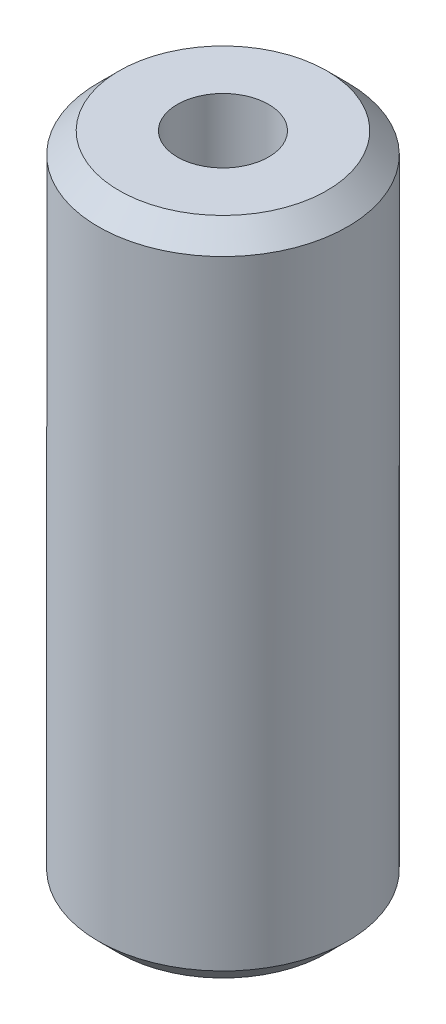
ISO-10303-21;
HEADER;
FILE_DESCRIPTION(('STEP AP214'),'2;1');
FILE_NAME('part.step','',(''),(''),'','','');
FILE_SCHEMA(('AUTOMOTIVE_DESIGN { 1 0 10303 214 1 1 1 1 }'));
ENDSEC;
DATA;
#1=APPLICATION_CONTEXT('core data for automotive mechanical design processes');
#2=APPLICATION_PROTOCOL_DEFINITION('international standard','automotive_design',2000,#1);
#3=PRODUCT_CONTEXT('',#1,'mechanical');
#4=PRODUCT('Part','Part','',(#3));
#5=PRODUCT_RELATED_PRODUCT_CATEGORY('part','',(#4));
#6=PRODUCT_DEFINITION_FORMATION('','',#4);
#7=PRODUCT_DEFINITION_CONTEXT('part definition',#1,'design');
#8=PRODUCT_DEFINITION('design','',#6,#7);
#9=PRODUCT_DEFINITION_SHAPE('','',#8);
#10=(LENGTH_UNIT() NAMED_UNIT(*) SI_UNIT(.MILLI.,.METRE.));
#11=(NAMED_UNIT(*) PLANE_ANGLE_UNIT() SI_UNIT($,.RADIAN.));
#12=(NAMED_UNIT(*) SI_UNIT($,.STERADIAN.) SOLID_ANGLE_UNIT());
#13=UNCERTAINTY_MEASURE_WITH_UNIT(LENGTH_MEASURE(1.E-05),#10,'distance_accuracy_value','');
#14=(GEOMETRIC_REPRESENTATION_CONTEXT(3) GLOBAL_UNCERTAINTY_ASSIGNED_CONTEXT((#13)) GLOBAL_UNIT_ASSIGNED_CONTEXT((#10,
#11,#12)) REPRESENTATION_CONTEXT('',''));
#15=CARTESIAN_POINT('',(0.,0.,0.));
#16=DIRECTION('',(0.,0.,1.));
#17=DIRECTION('',(1.,0.,0.));
#18=AXIS2_PLACEMENT_3D('',#15,#16,#17);
#19=CARTESIAN_POINT('',(0.,158.910353637575,0.));
#20=DIRECTION('',(0.,-1.,0.));
#21=DIRECTION('',(0.,0.,-1.));
#22=AXIS2_PLACEMENT_3D('',#19,#20,#21);
#23=CYLINDRICAL_SURFACE('',#22,30.);
#24=CARTESIAN_POINT('',(0.,153.892298129255,0.));
#25=DIRECTION('',(0.,1.,0.));
#26=DIRECTION('',(0.,0.,1.));
#27=AXIS2_PLACEMENT_3D('',#24,#25,#26);
#28=CIRCLE('',#27,30.);
#29=CARTESIAN_POINT('',(0.,153.892298129255,-30.));
#30=VERTEX_POINT('',#29);
#31=EDGE_CURVE('E50',#30,#30,#28,.F.);
#32=CARTESIAN_POINT('',(0.,5.0180555083208,0.));
#33=DIRECTION('',(0.,1.,0.));
#34=DIRECTION('',(0.,0.,1.));
#35=AXIS2_PLACEMENT_3D('',#32,#33,#34);
#36=CIRCLE('',#35,30.);
#37=CARTESIAN_POINT('',(0.,5.0180555083208,-30.));
#38=VERTEX_POINT('',#37);
#39=EDGE_CURVE('E51',#38,#38,#36,.T.);
#40=CARTESIAN_POINT('',(0.,153.892298129255,-30.));
#41=CARTESIAN_POINT('',(0.,152.34152476862,-30.));
#42=CARTESIAN_POINT('',(0.,150.790751407985,-30.));
#43=CARTESIAN_POINT('',(0.,147.689204686716,-30.));
#44=CARTESIAN_POINT('',(0.,146.138431326081,-30.));
#45=CARTESIAN_POINT('',(0.,143.036884604812,-30.));
#46=CARTESIAN_POINT('',(0.,141.486111244177,-30.));
#47=CARTESIAN_POINT('',(0.,138.384564522907,-30.));
#48=CARTESIAN_POINT('',(0.,136.833791162273,-30.));
#49=CARTESIAN_POINT('',(0.,133.732244441003,-30.));
#50=CARTESIAN_POINT('',(0.,132.181471080368,-30.));
#51=CARTESIAN_POINT('',(0.,129.079924359099,-30.));
#52=CARTESIAN_POINT('',(0.,127.529150998464,-30.));
#53=CARTESIAN_POINT('',(0.,124.427604277195,-30.));
#54=CARTESIAN_POINT('',(0.,122.87683091656,-30.));
#55=CARTESIAN_POINT('',(0.,119.775284195291,-30.));
#56=CARTESIAN_POINT('',(0.,118.224510834656,-30.));
#57=CARTESIAN_POINT('',(0.,115.122964113386,-30.));
#58=CARTESIAN_POINT('',(0.,113.572190752752,-30.));
#59=CARTESIAN_POINT('',(0.,110.470644031482,-30.));
#60=CARTESIAN_POINT('',(0.,108.919870670848,-30.));
#61=CARTESIAN_POINT('',(0.,105.818323949578,-30.));
#62=CARTESIAN_POINT('',(0.,104.267550588943,-30.));
#63=CARTESIAN_POINT('',(0.,101.166003867674,-30.));
#64=CARTESIAN_POINT('',(0.,99.6152305070392,-30.));
#65=CARTESIAN_POINT('',(0.,96.5136837857697,-30.));
#66=CARTESIAN_POINT('',(0.,94.962910425135,-30.));
#67=CARTESIAN_POINT('',(0.,91.8613637038656,-30.));
#68=CARTESIAN_POINT('',(0.,90.3105903432308,-30.));
#69=CARTESIAN_POINT('',(0.,87.2090436219614,-30.));
#70=CARTESIAN_POINT('',(0.,85.6582702613266,-30.));
#71=CARTESIAN_POINT('',(0.,82.5567235400572,-30.));
#72=CARTESIAN_POINT('',(0.,81.0059501794225,-30.));
#73=CARTESIAN_POINT('',(0.,77.904403458153,-30.));
#74=CARTESIAN_POINT('',(0.,76.3536300975183,-30.));
#75=CARTESIAN_POINT('',(0.,73.2520833762488,-30.));
#76=CARTESIAN_POINT('',(0.,71.7013100156141,-30.));
#77=CARTESIAN_POINT('',(0.,68.5997632943446,-30.));
#78=CARTESIAN_POINT('',(0.,67.0489899337099,-30.));
#79=CARTESIAN_POINT('',(0.,63.9474432124404,-30.));
#80=CARTESIAN_POINT('',(0.,62.3966698518057,-30.));
#81=CARTESIAN_POINT('',(0.,59.2951231305363,-30.));
#82=CARTESIAN_POINT('',(0.,57.7443497699015,-30.));
#83=CARTESIAN_POINT('',(0.,54.6428030486321,-30.));
#84=CARTESIAN_POINT('',(0.,53.0920296879974,-30.));
#85=CARTESIAN_POINT('',(0.,49.9904829667279,-30.));
#86=CARTESIAN_POINT('',(0.,48.4397096060932,-30.));
#87=CARTESIAN_POINT('',(0.,45.3381628848237,-30.));
#88=CARTESIAN_POINT('',(0.,43.787389524189,-30.));
#89=CARTESIAN_POINT('',(0.,40.6858428029195,-30.));
#90=CARTESIAN_POINT('',(0.,39.1350694422848,-30.));
#91=CARTESIAN_POINT('',(0.,36.0335227210154,-30.));
#92=CARTESIAN_POINT('',(0.,34.4827493603806,-30.));
#93=CARTESIAN_POINT('',(0.,31.3812026391112,-30.));
#94=CARTESIAN_POINT('',(0.,29.8304292784764,-30.));
#95=CARTESIAN_POINT('',(0.,26.728882557207,-30.));
#96=CARTESIAN_POINT('',(0.,25.1781091965722,-30.));
#97=CARTESIAN_POINT('',(0.,22.0765624753028,-30.));
#98=CARTESIAN_POINT('',(0.,20.5257891146681,-30.));
#99=CARTESIAN_POINT('',(0.,17.4242423933986,-30.));
#100=CARTESIAN_POINT('',(0.,15.8734690327639,-30.));
#101=CARTESIAN_POINT('',(0.,12.7719223114944,-30.));
#102=CARTESIAN_POINT('',(0.,11.2211489508597,-30.));
#103=CARTESIAN_POINT('',(0.,8.11960222959026,-30.));
#104=CARTESIAN_POINT('',(0.,6.56882886895553,-30.));
#105=CARTESIAN_POINT('',(0.,5.0180555083208,-30.));
#106=B_SPLINE_CURVE_WITH_KNOTS('',3,(#40,#41,#42,#43,#44,#45,#46,#47,#48,#49,#50,#51,#52,#53,
#54,#55,#56,#57,#58,#59,#60,#61,#62,#63,#64,#65,#66,#67,#68,#69,#70,#71,#72,#73,#74,#75,#76,#77,
#78,#79,#80,#81,#82,#83,#84,#85,#86,#87,#88,#89,#90,#91,#92,#93,#94,#95,#96,#97,#98,#99,#100,
#101,#102,#103,#104,#105),.UNSPECIFIED.,.F.,.F.,(4,2,2,2,2,2,2,2,2,2,2,2,2,2,2,2,2,2,2,2,2,2,2,
2,2,2,2,2,2,2,2,2,4),(0.,4.65232008190419,9.30464016380839,13.9569602457126,18.6092803276167,
23.2616004095209,27.9139204914251,32.5662405733293,37.2185606552335,41.8708807371377,
46.5232008190419,51.175520900946,55.8278409828502,60.4801610647544,65.1324811466586,
69.7848012285628,74.437121310467,79.0894413923711,83.7417614742753,88.3940815561795,
93.0464016380837,97.6987217199879,102.351041801892,107.003361883796,111.6556819657,
116.308002047605,120.960322129509,125.612642211413,130.264962293317,134.917282375221,
139.569602457126,144.22192253903,148.874242620934),.UNSPECIFIED.);
#107=EDGE_CURVE('BSEAM39',#30,#38,#106,.T.);
#108=ORIENTED_EDGE('',*,*,#31,.T.);
#109=ORIENTED_EDGE('',*,*,#39,.T.);
#110=ORIENTED_EDGE('',*,*,#107,.T.);
#111=ORIENTED_EDGE('',*,*,#107,.F.);
#112=EDGE_LOOP('',(#108,#110,#109,#111));
#113=FACE_BOUND('',#112,.T.);
#114=ADVANCED_FACE('F39',(#113),#23,.T.);
#115=CARTESIAN_POINT('',(0.,158.910353637575,0.));
#116=DIRECTION('',(0.,1.,0.));
#117=DIRECTION('',(0.,0.,1.));
#118=AXIS2_PLACEMENT_3D('',#115,#116,#117);
#119=PLANE('',#118);
#120=CARTESIAN_POINT('',(0.,158.910353637575,0.));
#121=DIRECTION('',(0.,1.,0.));
#122=DIRECTION('',(0.,0.,1.));
#123=AXIS2_PLACEMENT_3D('',#120,#121,#122);
#124=CIRCLE('',#123,24.9819444916793);
#125=CARTESIAN_POINT('',(0.,158.910353637575,-24.9819444916793));
#126=VERTEX_POINT('',#125);
#127=EDGE_CURVE('E54',#126,#126,#124,.T.);
#128=ORIENTED_EDGE('',*,*,#127,.T.);
#129=EDGE_LOOP('',(#128));
#130=FACE_BOUND('',#129,.T.);
#131=CARTESIAN_POINT('',(0.,158.910353637575,0.));
#132=DIRECTION('',(0.,1.,0.));
#133=DIRECTION('',(0.,0.,1.));
#134=AXIS2_PLACEMENT_3D('',#131,#132,#133);
#135=CIRCLE('',#134,10.9834278738878);
#136=CARTESIAN_POINT('',(0.,158.910353637575,10.9834278738878));
#137=VERTEX_POINT('',#136);
#138=EDGE_CURVE('E58',#137,#137,#135,.T.);
#139=ORIENTED_EDGE('',*,*,#138,.F.);
#140=EDGE_LOOP('',(#139));
#141=FACE_BOUND('',#140,.T.);
#142=ADVANCED_FACE('F69',(#130,#141),#119,.T.);
#143=CARTESIAN_POINT('',(0.,0.,0.));
#144=DIRECTION('',(0.,1.,0.));
#145=DIRECTION('',(0.,0.,1.));
#146=AXIS2_PLACEMENT_3D('',#143,#144,#145);
#147=PLANE('',#146);
#148=CARTESIAN_POINT('',(0.,0.,0.));
#149=DIRECTION('',(0.,1.,0.));
#150=DIRECTION('',(0.,0.,1.));
#151=AXIS2_PLACEMENT_3D('',#148,#149,#150);
#152=CIRCLE('',#151,24.9819444916792);
#153=CARTESIAN_POINT('',(0.,0.,24.9819444916792));
#154=VERTEX_POINT('',#153);
#155=EDGE_CURVE('E10',#154,#154,#152,.F.);
#156=ORIENTED_EDGE('',*,*,#155,.T.);
#157=EDGE_LOOP('',(#156));
#158=FACE_BOUND('',#157,.T.);
#159=CARTESIAN_POINT('',(0.,0.,0.));
#160=DIRECTION('',(0.,1.,0.));
#161=DIRECTION('',(0.,0.,1.));
#162=AXIS2_PLACEMENT_3D('',#159,#160,#161);
#163=CIRCLE('',#162,10.9834278738878);
#164=CARTESIAN_POINT('',(0.,0.,10.9834278738878));
#165=VERTEX_POINT('',#164);
#166=EDGE_CURVE('E63',#165,#165,#163,.T.);
#167=ORIENTED_EDGE('',*,*,#166,.T.);
#168=EDGE_LOOP('',(#167));
#169=FACE_BOUND('',#168,.T.);
#170=ADVANCED_FACE('F75',(#158,#169),#147,.F.);
#171=CARTESIAN_POINT('',(0.,158.910353637575,0.));
#172=DIRECTION('',(0.,-1.,0.));
#173=DIRECTION('',(0.,0.,-1.));
#174=AXIS2_PLACEMENT_3D('',#171,#172,#173);
#175=CYLINDRICAL_SURFACE('',#174,10.9834278738878);
#176=ORIENTED_EDGE('',*,*,#138,.T.);
#177=EDGE_LOOP('',(#176));
#178=FACE_BOUND('',#177,.T.);
#179=ORIENTED_EDGE('',*,*,#166,.F.);
#180=EDGE_LOOP('',(#179));
#181=FACE_BOUND('',#180,.T.);
#182=ADVANCED_FACE('F70',(#178,#181),#175,.F.);
#183=CARTESIAN_POINT('',(0.,158.910353637575,0.));
#184=DIRECTION('',(0.,-1.,0.));
#185=DIRECTION('',(0.,0.,-1.));
#186=AXIS2_PLACEMENT_3D('',#183,#184,#185);
#187=CONICAL_SURFACE('',#186,24.9819444916793,0.785398163397443);
#188=CARTESIAN_POINT('',(0.,153.892298129255,-30.));
#189=CARTESIAN_POINT('',(0.,153.9445695408,-29.947728588455));
#190=CARTESIAN_POINT('',(0.,153.996840952345,-29.89545717691));
#191=CARTESIAN_POINT('',(0.,154.101383775435,-29.79091435382));
#192=CARTESIAN_POINT('',(0.,154.15365518698,-29.738642942275));
#193=CARTESIAN_POINT('',(0.,154.25819801007,-29.634100119185));
#194=CARTESIAN_POINT('',(0.,154.310469421615,-29.58182870764));
#195=CARTESIAN_POINT('',(0.,154.415012244705,-29.4772858845499));
#196=CARTESIAN_POINT('',(0.,154.46728365625,-29.4250144730049));
#197=CARTESIAN_POINT('',(0.,154.57182647934,-29.3204716499149));
#198=CARTESIAN_POINT('',(0.,154.624097890885,-29.2682002383699));
#199=CARTESIAN_POINT('',(0.,154.728640713975,-29.1636574152799));
#200=CARTESIAN_POINT('',(0.,154.78091212552,-29.1113860037349));
#201=CARTESIAN_POINT('',(0.,154.88545494861,-29.0068431806449));
#202=CARTESIAN_POINT('',(0.,154.937726360155,-28.9545717690999));
#203=CARTESIAN_POINT('',(0.,155.042269183245,-28.8500289460098));
#204=CARTESIAN_POINT('',(0.,155.09454059479,-28.7977575344648));
#205=CARTESIAN_POINT('',(0.,155.19908341788,-28.6932147113748));
#206=CARTESIAN_POINT('',(0.,155.251354829425,-28.6409432998298));
#207=CARTESIAN_POINT('',(0.,155.355897652515,-28.5364004767398));
#208=CARTESIAN_POINT('',(0.,155.40816906406,-28.4841290651948));
#209=CARTESIAN_POINT('',(0.,155.51271188715,-28.3795862421048));
#210=CARTESIAN_POINT('',(0.,155.564983298695,-28.3273148305598));
#211=CARTESIAN_POINT('',(0.,155.669526121785,-28.2227720074698));
#212=CARTESIAN_POINT('',(0.,155.72179753333,-28.1705005959247));
#213=CARTESIAN_POINT('',(0.,155.82634035642,-28.0659577728347));
#214=CARTESIAN_POINT('',(0.,155.878611767965,-28.0136863612897));
#215=CARTESIAN_POINT('',(0.,155.983154591055,-27.9091435381997));
#216=CARTESIAN_POINT('',(0.,156.0354260026,-27.8568721266547));
#217=CARTESIAN_POINT('',(0.,156.13996882569,-27.7523293035647));
#218=CARTESIAN_POINT('',(0.,156.192240237235,-27.7000578920197));
#219=CARTESIAN_POINT('',(0.,156.296783060325,-27.5955150689297));
#220=CARTESIAN_POINT('',(0.,156.34905447187,-27.5432436573847));
#221=CARTESIAN_POINT('',(0.,156.45359729496,-27.4387008342946));
#222=CARTESIAN_POINT('',(0.,156.505868706505,-27.3864294227496));
#223=CARTESIAN_POINT('',(0.,156.610411529595,-27.2818865996596));
#224=CARTESIAN_POINT('',(0.,156.66268294114,-27.2296151881146));
#225=CARTESIAN_POINT('',(0.,156.76722576423,-27.1250723650246));
#226=CARTESIAN_POINT('',(0.,156.819497175775,-27.0728009534796));
#227=CARTESIAN_POINT('',(0.,156.924039998865,-26.9682581303896));
#228=CARTESIAN_POINT('',(0.,156.97631141041,-26.9159867188446));
#229=CARTESIAN_POINT('',(0.,157.0808542335,-26.8114438957545));
#230=CARTESIAN_POINT('',(0.,157.133125645045,-26.7591724842095));
#231=CARTESIAN_POINT('',(0.,157.237668468135,-26.6546296611195));
#232=CARTESIAN_POINT('',(0.,157.28993987968,-26.6023582495745));
#233=CARTESIAN_POINT('',(0.,157.39448270277,-26.4978154264845));
#234=CARTESIAN_POINT('',(0.,157.446754114315,-26.4455440149395));
#235=CARTESIAN_POINT('',(0.,157.551296937405,-26.3410011918495));
#236=CARTESIAN_POINT('',(0.,157.60356834895,-26.2887297803045));
#237=CARTESIAN_POINT('',(0.,157.70811117204,-26.1841869572144));
#238=CARTESIAN_POINT('',(0.,157.760382583585,-26.1319155456694));
#239=CARTESIAN_POINT('',(0.,157.864925406675,-26.0273727225794));
#240=CARTESIAN_POINT('',(0.,157.91719681822,-25.9751013110344));
#241=CARTESIAN_POINT('',(0.,158.02173964131,-25.8705584879444));
#242=CARTESIAN_POINT('',(0.,158.074011052855,-25.8182870763994));
#243=CARTESIAN_POINT('',(0.,158.178553875945,-25.7137442533094));
#244=CARTESIAN_POINT('',(0.,158.23082528749,-25.6614728417644));
#245=CARTESIAN_POINT('',(0.,158.33536811058,-25.5569300186744));
#246=CARTESIAN_POINT('',(0.,158.387639522125,-25.5046586071294));
#247=CARTESIAN_POINT('',(0.,158.492182345215,-25.4001157840393));
#248=CARTESIAN_POINT('',(0.,158.54445375676,-25.3478443724943));
#249=CARTESIAN_POINT('',(0.,158.64899657985,-25.2433015494043));
#250=CARTESIAN_POINT('',(0.,158.701267991395,-25.1910301378593));
#251=CARTESIAN_POINT('',(0.,158.805810814485,-25.0864873147693));
#252=CARTESIAN_POINT('',(0.,158.85808222603,-25.0342159032243));
#253=CARTESIAN_POINT('',(0.,158.910353637575,-24.9819444916793));
#254=B_SPLINE_CURVE_WITH_KNOTS('',3,(#188,#189,#190,#191,#192,#193,#194,#195,#196,#197,#198,
#199,#200,#201,#202,#203,#204,#205,#206,#207,#208,#209,#210,#211,#212,#213,#214,#215,#216,#217,
#218,#219,#220,#221,#222,#223,#224,#225,#226,#227,#228,#229,#230,#231,#232,#233,#234,#235,#236,
#237,#238,#239,#240,#241,#242,#243,#244,#245,#246,#247,#248,#249,#250,#251,#252,#253),
.UNSPECIFIED.,.F.,.F.,(4,2,2,2,2,2,2,2,2,2,2,2,2,2,2,2,2,2,2,2,2,2,2,2,2,2,2,2,2,2,2,2,4),(0.,
0.221768817394016,0.443537634788013,0.665306452182032,0.887075269576031,1.10884408697005,
1.33061290436404,1.55238172175806,1.77415053915206,1.99591935654608,2.21768817394007,
2.43945699133409,2.66122580872809,2.88299462612211,3.10476344351611,3.32653226091012,
3.54830107830412,3.77006989569814,3.99183871309214,4.21360753048615,4.43537634788015,
4.65714516527417,4.87891398266817,5.10068280006218,5.32245161745618,5.5442204348502,
5.76598925224422,5.98775806963821,6.20952688703223,6.43129570442623,6.65306452182025,
6.87483333921424,7.09660215660826),.UNSPECIFIED.);
#255=EDGE_CURVE('BSEAM81',#30,#126,#254,.T.);
#256=ORIENTED_EDGE('',*,*,#31,.F.);
#257=ORIENTED_EDGE('',*,*,#127,.F.);
#258=ORIENTED_EDGE('',*,*,#255,.T.);
#259=ORIENTED_EDGE('',*,*,#255,.F.);
#260=EDGE_LOOP('',(#256,#258,#257,#259));
#261=FACE_BOUND('',#260,.T.);
#262=ADVANCED_FACE('F81',(#261),#187,.T.);
#263=CARTESIAN_POINT('',(0.,5.0180555083208,0.));
#264=DIRECTION('',(0.,1.,0.));
#265=DIRECTION('',(0.,0.,1.));
#266=AXIS2_PLACEMENT_3D('',#263,#264,#265);
#267=CONICAL_SURFACE('',#266,30.,0.78539816339745);
#268=ORIENTED_EDGE('',*,*,#155,.F.);
#269=EDGE_LOOP('',(#268));
#270=FACE_BOUND('',#269,.T.);
#271=ORIENTED_EDGE('',*,*,#39,.F.);
#272=EDGE_LOOP('',(#271));
#273=FACE_BOUND('',#272,.T.);
#274=ADVANCED_FACE('F45',(#270,#273),#267,.T.);
#275=CLOSED_SHELL('',(#114,#142,#170,#182,#262,#274));
#276=MANIFOLD_SOLID_BREP('B2',#275);
#277=ADVANCED_BREP_SHAPE_REPRESENTATION('',(#18,#276),#14);
#278=SHAPE_DEFINITION_REPRESENTATION(#9,#277);
ENDSEC;
END-ISO-10303-21;
